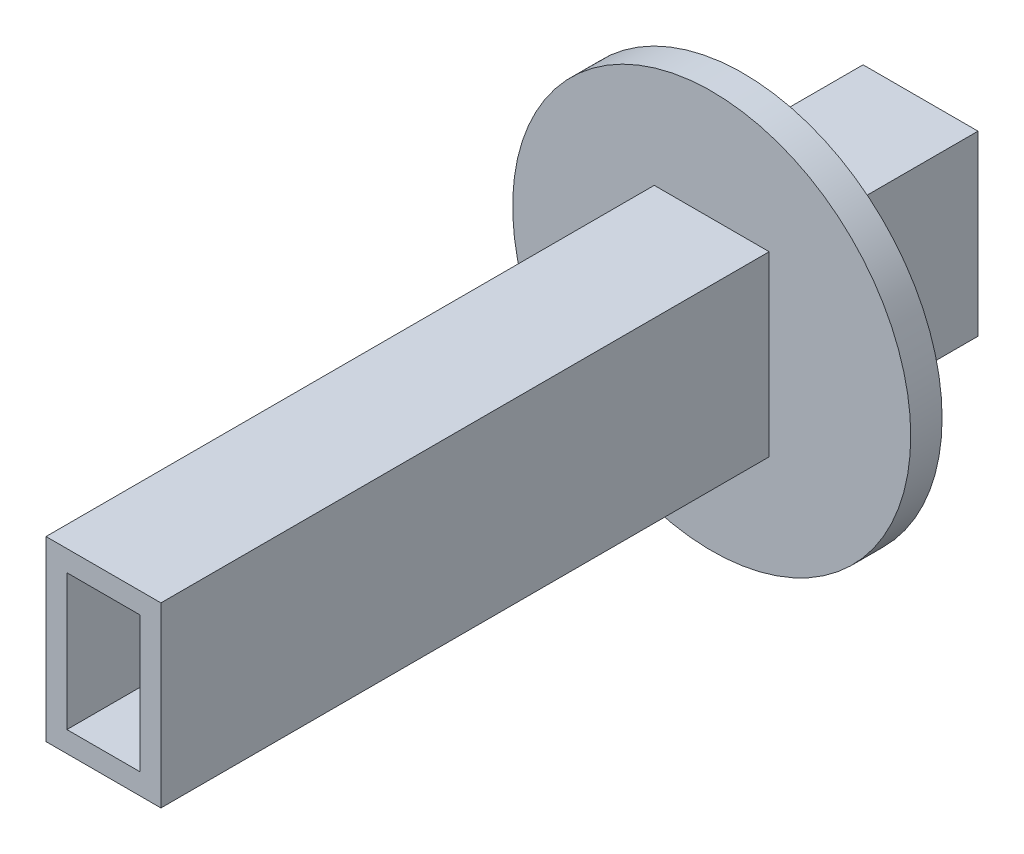
ISO-10303-21;
HEADER;
FILE_DESCRIPTION(('STEP AP214'),'2;1');
FILE_NAME('part.step','',(''),(''),'','','');
FILE_SCHEMA(('AUTOMOTIVE_DESIGN { 1 0 10303 214 1 1 1 1 }'));
ENDSEC;
DATA;
#1=APPLICATION_CONTEXT('core data for automotive mechanical design processes');
#2=APPLICATION_PROTOCOL_DEFINITION('international standard','automotive_design',2000,#1);
#3=PRODUCT_CONTEXT('',#1,'mechanical');
#4=PRODUCT('Part','Part','',(#3));
#5=PRODUCT_RELATED_PRODUCT_CATEGORY('part','',(#4));
#6=PRODUCT_DEFINITION_FORMATION('','',#4);
#7=PRODUCT_DEFINITION_CONTEXT('part definition',#1,'design');
#8=PRODUCT_DEFINITION('design','',#6,#7);
#9=PRODUCT_DEFINITION_SHAPE('','',#8);
#10=(LENGTH_UNIT() NAMED_UNIT(*) SI_UNIT(.MILLI.,.METRE.));
#11=(NAMED_UNIT(*) PLANE_ANGLE_UNIT() SI_UNIT($,.RADIAN.));
#12=(NAMED_UNIT(*) SI_UNIT($,.STERADIAN.) SOLID_ANGLE_UNIT());
#13=UNCERTAINTY_MEASURE_WITH_UNIT(LENGTH_MEASURE(1.E-05),#10,'distance_accuracy_value','');
#14=(GEOMETRIC_REPRESENTATION_CONTEXT(3) GLOBAL_UNCERTAINTY_ASSIGNED_CONTEXT((#13)) GLOBAL_UNIT_ASSIGNED_CONTEXT((#10,
#11,#12)) REPRESENTATION_CONTEXT('',''));
#15=CARTESIAN_POINT('',(0.,0.,0.));
#16=DIRECTION('',(0.,0.,1.));
#17=DIRECTION('',(1.,0.,0.));
#18=AXIS2_PLACEMENT_3D('',#15,#16,#17);
#19=CARTESIAN_POINT('',(3.5,6.5,14.986));
#20=DIRECTION('',(0.,0.,1.));
#21=DIRECTION('',(1.,0.,0.));
#22=AXIS2_PLACEMENT_3D('',#19,#20,#21);
#23=PLANE('',#22);
#24=CARTESIAN_POINT('',(3.5,6.5,14.986));
#25=DIRECTION('',(0.,0.,1.));
#26=DIRECTION('',(1.,0.,0.));
#27=AXIS2_PLACEMENT_3D('',#24,#25,#26);
#28=CIRCLE('',#27,19.05);
#29=CARTESIAN_POINT('',(22.55,6.5,14.986));
#30=VERTEX_POINT('',#29);
#31=EDGE_CURVE('E291',#30,#30,#28,.T.);
#32=ORIENTED_EDGE('',*,*,#31,.F.);
#33=EDGE_LOOP('',(#32));
#34=FACE_BOUND('',#33,.T.);
#35=CARTESIAN_POINT('',(3.5,6.5,14.986));
#36=DIRECTION('',(0.,0.,1.));
#37=DIRECTION('',(1.,0.,0.));
#38=AXIS2_PLACEMENT_3D('',#35,#36,#37);
#39=CIRCLE('',#38,12.7);
#40=CARTESIAN_POINT('',(16.2,6.5,14.986));
#41=VERTEX_POINT('',#40);
#42=EDGE_CURVE('E11',#41,#41,#39,.F.);
#43=ORIENTED_EDGE('',*,*,#42,.F.);
#44=EDGE_LOOP('',(#43));
#45=FACE_BOUND('',#44,.T.);
#46=ADVANCED_FACE('F39',(#34,#45),#23,.F.);
#47=CARTESIAN_POINT('',(-2.,-2.,76.2));
#48=DIRECTION('',(1.,0.,0.));
#49=DIRECTION('',(0.,0.,-1.));
#50=AXIS2_PLACEMENT_3D('',#47,#48,#49);
#51=PLANE('',#50);
#52=DIRECTION('',(0.,0.,-1.));
#53=VECTOR('',#52,1.);
#54=CARTESIAN_POINT('',(-2.,-2.,76.2));
#55=LINE('',#54,#53);
#56=CARTESIAN_POINT('',(-2.,-2.,12.446));
#57=VERTEX_POINT('',#56);
#58=CARTESIAN_POINT('',(-2.,-2.,-2.));
#59=VERTEX_POINT('',#58);
#60=EDGE_CURVE('E168',#57,#59,#55,.T.);
#61=ORIENTED_EDGE('',*,*,#60,.F.);
#62=DIRECTION('',(0.,1.,0.));
#63=VECTOR('',#62,1.);
#64=CARTESIAN_POINT('',(-2.,15.,12.446));
#65=LINE('',#64,#63);
#66=CARTESIAN_POINT('',(-2.,15.,12.446));
#67=VERTEX_POINT('',#66);
#68=EDGE_CURVE('E142',#57,#67,#65,.T.);
#69=ORIENTED_EDGE('',*,*,#68,.T.);
#70=DIRECTION('',(0.,0.,-1.));
#71=VECTOR('',#70,1.);
#72=CARTESIAN_POINT('',(-2.,15.,76.2));
#73=LINE('',#72,#71);
#74=CARTESIAN_POINT('',(-2.,15.,-2.));
#75=VERTEX_POINT('',#74);
#76=EDGE_CURVE('E191',#67,#75,#73,.T.);
#77=ORIENTED_EDGE('',*,*,#76,.T.);
#78=DIRECTION('',(0.,1.,0.));
#79=VECTOR('',#78,1.);
#80=CARTESIAN_POINT('',(-2.,-2.,-2.));
#81=LINE('',#80,#79);
#82=EDGE_CURVE('E184',#59,#75,#81,.T.);
#83=ORIENTED_EDGE('',*,*,#82,.F.);
#84=EDGE_LOOP('',(#61,#69,#77,#83));
#85=FACE_BOUND('',#84,.T.);
#86=ADVANCED_FACE('F189',(#85),#51,.F.);
#87=CARTESIAN_POINT('',(-2.,-2.,76.2));
#88=DIRECTION('',(0.,1.,0.));
#89=DIRECTION('',(0.,0.,1.));
#90=AXIS2_PLACEMENT_3D('',#87,#88,#89);
#91=PLANE('',#90);
#92=DIRECTION('',(0.,0.,-1.));
#93=VECTOR('',#92,1.);
#94=CARTESIAN_POINT('',(0.,-2.,0.));
#95=LINE('',#94,#93);
#96=CARTESIAN_POINT('',(0.,-2.,11.));
#97=VERTEX_POINT('',#96);
#98=CARTESIAN_POINT('',(0.,-2.,0.));
#99=VERTEX_POINT('',#98);
#100=EDGE_CURVE('E284',#97,#99,#95,.T.);
#101=ORIENTED_EDGE('',*,*,#100,.F.);
#102=DIRECTION('',(-1.,0.,0.));
#103=VECTOR('',#102,1.);
#104=CARTESIAN_POINT('',(7.,-2.,11.));
#105=LINE('',#104,#103);
#106=CARTESIAN_POINT('',(7.,-2.,11.));
#107=VERTEX_POINT('',#106);
#108=EDGE_CURVE('E279',#107,#97,#105,.T.);
#109=ORIENTED_EDGE('',*,*,#108,.F.);
#110=DIRECTION('',(0.,0.,1.));
#111=VECTOR('',#110,1.);
#112=CARTESIAN_POINT('',(7.,-2.,0.));
#113=LINE('',#112,#111);
#114=CARTESIAN_POINT('',(7.,-2.,0.));
#115=VERTEX_POINT('',#114);
#116=EDGE_CURVE('E275',#115,#107,#113,.T.);
#117=ORIENTED_EDGE('',*,*,#116,.F.);
#118=DIRECTION('',(1.,0.,0.));
#119=VECTOR('',#118,1.);
#120=CARTESIAN_POINT('',(7.,-2.,0.));
#121=LINE('',#120,#119);
#122=EDGE_CURVE('E274',#99,#115,#121,.T.);
#123=ORIENTED_EDGE('',*,*,#122,.F.);
#124=EDGE_LOOP('',(#101,#109,#117,#123));
#125=FACE_BOUND('',#124,.T.);
#126=DIRECTION('',(0.,0.,-1.));
#127=VECTOR('',#126,1.);
#128=CARTESIAN_POINT('',(9.,-2.,76.2));
#129=LINE('',#128,#127);
#130=CARTESIAN_POINT('',(9.,-2.,12.446));
#131=VERTEX_POINT('',#130);
#132=CARTESIAN_POINT('',(9.,-2.,-2.));
#133=VERTEX_POINT('',#132);
#134=EDGE_CURVE('E152',#131,#133,#129,.T.);
#135=ORIENTED_EDGE('',*,*,#134,.F.);
#136=DIRECTION('',(-1.,0.,0.));
#137=VECTOR('',#136,1.);
#138=CARTESIAN_POINT('',(9.,-2.,12.446));
#139=LINE('',#138,#137);
#140=EDGE_CURVE('E139',#131,#57,#139,.T.);
#141=ORIENTED_EDGE('',*,*,#140,.T.);
#142=ORIENTED_EDGE('',*,*,#60,.T.);
#143=DIRECTION('',(-1.,0.,0.));
#144=VECTOR('',#143,1.);
#145=CARTESIAN_POINT('',(9.,-2.,-2.));
#146=LINE('',#145,#144);
#147=EDGE_CURVE('E159',#133,#59,#146,.T.);
#148=ORIENTED_EDGE('',*,*,#147,.F.);
#149=EDGE_LOOP('',(#135,#141,#142,#148));
#150=FACE_BOUND('',#149,.T.);
#151=ADVANCED_FACE('F157',(#125,#150),#91,.F.);
#152=CARTESIAN_POINT('',(9.,-2.,76.2));
#153=DIRECTION('',(-1.,0.,0.));
#154=DIRECTION('',(0.,0.,1.));
#155=AXIS2_PLACEMENT_3D('',#152,#153,#154);
#156=PLANE('',#155);
#157=DIRECTION('',(0.,0.,-1.));
#158=VECTOR('',#157,1.);
#159=CARTESIAN_POINT('',(9.,15.,76.2));
#160=LINE('',#159,#158);
#161=CARTESIAN_POINT('',(9.,15.,12.446));
#162=VERTEX_POINT('',#161);
#163=CARTESIAN_POINT('',(9.,15.,-2.));
#164=VERTEX_POINT('',#163);
#165=EDGE_CURVE('E154',#162,#164,#160,.T.);
#166=ORIENTED_EDGE('',*,*,#165,.F.);
#167=DIRECTION('',(0.,-1.,0.));
#168=VECTOR('',#167,1.);
#169=CARTESIAN_POINT('',(9.,15.,12.446));
#170=LINE('',#169,#168);
#171=EDGE_CURVE('E55',#162,#131,#170,.T.);
#172=ORIENTED_EDGE('',*,*,#171,.T.);
#173=ORIENTED_EDGE('',*,*,#134,.T.);
#174=DIRECTION('',(0.,-1.,0.));
#175=VECTOR('',#174,1.);
#176=CARTESIAN_POINT('',(9.,-2.,-2.));
#177=LINE('',#176,#175);
#178=EDGE_CURVE('E186',#164,#133,#177,.T.);
#179=ORIENTED_EDGE('',*,*,#178,.F.);
#180=EDGE_LOOP('',(#166,#172,#173,#179));
#181=FACE_BOUND('',#180,.T.);
#182=ADVANCED_FACE('F150',(#181),#156,.F.);
#183=CARTESIAN_POINT('',(-2.,15.,76.2));
#184=DIRECTION('',(0.,-1.,0.));
#185=DIRECTION('',(0.,0.,-1.));
#186=AXIS2_PLACEMENT_3D('',#183,#184,#185);
#187=PLANE('',#186);
#188=ORIENTED_EDGE('',*,*,#76,.F.);
#189=DIRECTION('',(1.,0.,0.));
#190=VECTOR('',#189,1.);
#191=CARTESIAN_POINT('',(9.,15.,12.446));
#192=LINE('',#191,#190);
#193=EDGE_CURVE('E261',#67,#162,#192,.T.);
#194=ORIENTED_EDGE('',*,*,#193,.T.);
#195=ORIENTED_EDGE('',*,*,#165,.T.);
#196=DIRECTION('',(1.,0.,0.));
#197=VECTOR('',#196,1.);
#198=CARTESIAN_POINT('',(9.,15.,-2.));
#199=LINE('',#198,#197);
#200=EDGE_CURVE('E193',#75,#164,#199,.T.);
#201=ORIENTED_EDGE('',*,*,#200,.F.);
#202=EDGE_LOOP('',(#188,#194,#195,#201));
#203=FACE_BOUND('',#202,.T.);
#204=ADVANCED_FACE('F260',(#203),#187,.F.);
#205=CARTESIAN_POINT('',(0.,0.,76.2));
#206=DIRECTION('',(0.,0.,-1.));
#207=DIRECTION('',(-1.,0.,0.));
#208=AXIS2_PLACEMENT_3D('',#205,#206,#207);
#209=PLANE('',#208);
#210=DIRECTION('',(0.,-1.,0.));
#211=VECTOR('',#210,1.);
#212=CARTESIAN_POINT('',(-2.,-2.,76.2));
#213=LINE('',#212,#211);
#214=CARTESIAN_POINT('',(-2.,15.,76.2));
#215=VERTEX_POINT('',#214);
#216=CARTESIAN_POINT('',(-2.,-2.,76.2));
#217=VERTEX_POINT('',#216);
#218=EDGE_CURVE('E239',#215,#217,#213,.T.);
#219=ORIENTED_EDGE('',*,*,#218,.T.);
#220=DIRECTION('',(1.,0.,0.));
#221=VECTOR('',#220,1.);
#222=CARTESIAN_POINT('',(-2.,-2.,76.2));
#223=LINE('',#222,#221);
#224=CARTESIAN_POINT('',(9.,-2.,76.2));
#225=VERTEX_POINT('',#224);
#226=EDGE_CURVE('E243',#217,#225,#223,.T.);
#227=ORIENTED_EDGE('',*,*,#226,.T.);
#228=DIRECTION('',(0.,1.,0.));
#229=VECTOR('',#228,1.);
#230=CARTESIAN_POINT('',(9.,-2.,76.2));
#231=LINE('',#230,#229);
#232=CARTESIAN_POINT('',(9.,15.,76.2));
#233=VERTEX_POINT('',#232);
#234=EDGE_CURVE('E246',#225,#233,#231,.T.);
#235=ORIENTED_EDGE('',*,*,#234,.T.);
#236=DIRECTION('',(-1.,0.,0.));
#237=VECTOR('',#236,1.);
#238=CARTESIAN_POINT('',(-2.,15.,76.2));
#239=LINE('',#238,#237);
#240=EDGE_CURVE('E249',#233,#215,#239,.T.);
#241=ORIENTED_EDGE('',*,*,#240,.T.);
#242=EDGE_LOOP('',(#219,#227,#235,#241));
#243=FACE_BOUND('',#242,.T.);
#244=DIRECTION('',(0.,-1.,0.));
#245=VECTOR('',#244,1.);
#246=CARTESIAN_POINT('',(0.,0.,76.2));
#247=LINE('',#246,#245);
#248=CARTESIAN_POINT('',(0.,13.,76.2));
#249=VERTEX_POINT('',#248);
#250=CARTESIAN_POINT('',(0.,0.,76.2));
#251=VERTEX_POINT('',#250);
#252=EDGE_CURVE('E200',#249,#251,#247,.T.);
#253=ORIENTED_EDGE('',*,*,#252,.F.);
#254=DIRECTION('',(-1.,0.,0.));
#255=VECTOR('',#254,1.);
#256=CARTESIAN_POINT('',(0.,13.,76.2));
#257=LINE('',#256,#255);
#258=CARTESIAN_POINT('',(7.,13.,76.2));
#259=VERTEX_POINT('',#258);
#260=EDGE_CURVE('E211',#259,#249,#257,.T.);
#261=ORIENTED_EDGE('',*,*,#260,.F.);
#262=DIRECTION('',(0.,1.,0.));
#263=VECTOR('',#262,1.);
#264=CARTESIAN_POINT('',(7.,0.,76.2));
#265=LINE('',#264,#263);
#266=CARTESIAN_POINT('',(7.,0.,76.2));
#267=VERTEX_POINT('',#266);
#268=EDGE_CURVE('E207',#267,#259,#265,.T.);
#269=ORIENTED_EDGE('',*,*,#268,.F.);
#270=DIRECTION('',(1.,0.,0.));
#271=VECTOR('',#270,1.);
#272=CARTESIAN_POINT('',(0.,0.,76.2));
#273=LINE('',#272,#271);
#274=EDGE_CURVE('E203',#251,#267,#273,.T.);
#275=ORIENTED_EDGE('',*,*,#274,.F.);
#276=EDGE_LOOP('',(#253,#261,#269,#275));
#277=FACE_BOUND('',#276,.T.);
#278=ADVANCED_FACE('F367',(#243,#277),#209,.F.);
#279=CARTESIAN_POINT('',(-2.,15.,17.986));
#280=VERTEX_POINT('',#279);
#281=EDGE_CURVE('E251',#215,#280,#73,.T.);
#282=ORIENTED_EDGE('',*,*,#281,.T.);
#283=DIRECTION('',(0.,-1.,0.));
#284=VECTOR('',#283,1.);
#285=CARTESIAN_POINT('',(-2.,15.,17.986));
#286=LINE('',#285,#284);
#287=CARTESIAN_POINT('',(-2.,-2.,17.986));
#288=VERTEX_POINT('',#287);
#289=EDGE_CURVE('E63',#280,#288,#286,.T.);
#290=ORIENTED_EDGE('',*,*,#289,.T.);
#291=EDGE_CURVE('E48',#217,#288,#55,.T.);
#292=ORIENTED_EDGE('',*,*,#291,.F.);
#293=ORIENTED_EDGE('',*,*,#218,.F.);
#294=EDGE_LOOP('',(#282,#290,#292,#293));
#295=FACE_BOUND('',#294,.T.);
#296=ADVANCED_FACE('F41',(#295),#51,.F.);
#297=ORIENTED_EDGE('',*,*,#291,.T.);
#298=DIRECTION('',(1.,0.,0.));
#299=VECTOR('',#298,1.);
#300=CARTESIAN_POINT('',(-2.,-2.,17.986));
#301=LINE('',#300,#299);
#302=CARTESIAN_POINT('',(9.,-2.,17.986));
#303=VERTEX_POINT('',#302);
#304=EDGE_CURVE('E305',#288,#303,#301,.T.);
#305=ORIENTED_EDGE('',*,*,#304,.T.);
#306=EDGE_CURVE('E162',#225,#303,#129,.T.);
#307=ORIENTED_EDGE('',*,*,#306,.F.);
#308=ORIENTED_EDGE('',*,*,#226,.F.);
#309=EDGE_LOOP('',(#297,#305,#307,#308));
#310=FACE_BOUND('',#309,.T.);
#311=ADVANCED_FACE('F376',(#310),#91,.F.);
#312=ORIENTED_EDGE('',*,*,#306,.T.);
#313=DIRECTION('',(0.,1.,0.));
#314=VECTOR('',#313,1.);
#315=CARTESIAN_POINT('',(9.,15.,17.986));
#316=LINE('',#315,#314);
#317=CARTESIAN_POINT('',(9.,15.,17.986));
#318=VERTEX_POINT('',#317);
#319=EDGE_CURVE('E301',#303,#318,#316,.T.);
#320=ORIENTED_EDGE('',*,*,#319,.T.);
#321=EDGE_CURVE('E163',#233,#318,#160,.T.);
#322=ORIENTED_EDGE('',*,*,#321,.F.);
#323=ORIENTED_EDGE('',*,*,#234,.F.);
#324=EDGE_LOOP('',(#312,#320,#322,#323));
#325=FACE_BOUND('',#324,.T.);
#326=ADVANCED_FACE('F373',(#325),#156,.F.);
#327=ORIENTED_EDGE('',*,*,#321,.T.);
#328=DIRECTION('',(-1.,0.,0.));
#329=VECTOR('',#328,1.);
#330=CARTESIAN_POINT('',(-2.,15.,17.986));
#331=LINE('',#330,#329);
#332=EDGE_CURVE('E295',#318,#280,#331,.T.);
#333=ORIENTED_EDGE('',*,*,#332,.T.);
#334=ORIENTED_EDGE('',*,*,#281,.F.);
#335=ORIENTED_EDGE('',*,*,#240,.F.);
#336=EDGE_LOOP('',(#327,#333,#334,#335));
#337=FACE_BOUND('',#336,.T.);
#338=ADVANCED_FACE('F365',(#337),#187,.F.);
#339=CARTESIAN_POINT('',(0.,0.,76.2));
#340=DIRECTION('',(1.,0.,0.));
#341=DIRECTION('',(0.,1.,0.));
#342=AXIS2_PLACEMENT_3D('',#339,#340,#341);
#343=PLANE('',#342);
#344=DIRECTION('',(0.,-1.,0.));
#345=VECTOR('',#344,1.);
#346=CARTESIAN_POINT('',(0.,0.,0.));
#347=LINE('',#346,#345);
#348=CARTESIAN_POINT('',(0.,13.,0.));
#349=VERTEX_POINT('',#348);
#350=EDGE_CURVE('E196',#349,#99,#347,.T.);
#351=ORIENTED_EDGE('',*,*,#350,.F.);
#352=DIRECTION('',(0.,0.,-1.));
#353=VECTOR('',#352,1.);
#354=CARTESIAN_POINT('',(0.,13.,76.2));
#355=LINE('',#354,#353);
#356=EDGE_CURVE('E214',#249,#349,#355,.T.);
#357=ORIENTED_EDGE('',*,*,#356,.F.);
#358=ORIENTED_EDGE('',*,*,#252,.T.);
#359=DIRECTION('',(0.,0.,-1.));
#360=VECTOR('',#359,1.);
#361=CARTESIAN_POINT('',(0.,0.,76.2));
#362=LINE('',#361,#360);
#363=CARTESIAN_POINT('',(0.,0.,11.));
#364=VERTEX_POINT('',#363);
#365=EDGE_CURVE('E235',#251,#364,#362,.T.);
#366=ORIENTED_EDGE('',*,*,#365,.T.);
#367=DIRECTION('',(0.,-1.,0.));
#368=VECTOR('',#367,1.);
#369=CARTESIAN_POINT('',(0.,13.0384048104053,11.));
#370=LINE('',#369,#368);
#371=EDGE_CURVE('E265',#364,#97,#370,.T.);
#372=ORIENTED_EDGE('',*,*,#371,.T.);
#373=ORIENTED_EDGE('',*,*,#100,.T.);
#374=EDGE_LOOP('',(#351,#357,#358,#366,#372,#373));
#375=FACE_BOUND('',#374,.T.);
#376=ADVANCED_FACE('F361',(#375),#343,.T.);
#377=CARTESIAN_POINT('',(0.,0.,76.2));
#378=DIRECTION('',(0.,1.,0.));
#379=DIRECTION('',(0.,0.,1.));
#380=AXIS2_PLACEMENT_3D('',#377,#378,#379);
#381=PLANE('',#380);
#382=DIRECTION('',(-1.,0.,0.));
#383=VECTOR('',#382,1.);
#384=CARTESIAN_POINT('',(7.,0.,11.));
#385=LINE('',#384,#383);
#386=CARTESIAN_POINT('',(7.,0.,11.));
#387=VERTEX_POINT('',#386);
#388=EDGE_CURVE('E270',#387,#364,#385,.T.);
#389=ORIENTED_EDGE('',*,*,#388,.T.);
#390=ORIENTED_EDGE('',*,*,#365,.F.);
#391=ORIENTED_EDGE('',*,*,#274,.T.);
#392=DIRECTION('',(0.,0.,-1.));
#393=VECTOR('',#392,1.);
#394=CARTESIAN_POINT('',(7.,0.,76.2));
#395=LINE('',#394,#393);
#396=EDGE_CURVE('E231',#267,#387,#395,.T.);
#397=ORIENTED_EDGE('',*,*,#396,.T.);
#398=EDGE_LOOP('',(#389,#390,#391,#397));
#399=FACE_BOUND('',#398,.T.);
#400=ADVANCED_FACE('F357',(#399),#381,.T.);
#401=CARTESIAN_POINT('',(7.,0.,76.2));
#402=DIRECTION('',(-1.,0.,0.));
#403=DIRECTION('',(0.,-1.,0.));
#404=AXIS2_PLACEMENT_3D('',#401,#402,#403);
#405=PLANE('',#404);
#406=DIRECTION('',(0.,1.,0.));
#407=VECTOR('',#406,1.);
#408=CARTESIAN_POINT('',(7.,0.,0.));
#409=LINE('',#408,#407);
#410=CARTESIAN_POINT('',(7.,13.,0.));
#411=VERTEX_POINT('',#410);
#412=EDGE_CURVE('E217',#115,#411,#409,.T.);
#413=ORIENTED_EDGE('',*,*,#412,.F.);
#414=ORIENTED_EDGE('',*,*,#116,.T.);
#415=DIRECTION('',(0.,-1.,0.));
#416=VECTOR('',#415,1.);
#417=CARTESIAN_POINT('',(7.,13.0384048104053,11.));
#418=LINE('',#417,#416);
#419=EDGE_CURVE('E263',#387,#107,#418,.T.);
#420=ORIENTED_EDGE('',*,*,#419,.F.);
#421=ORIENTED_EDGE('',*,*,#396,.F.);
#422=ORIENTED_EDGE('',*,*,#268,.T.);
#423=DIRECTION('',(0.,0.,-1.));
#424=VECTOR('',#423,1.);
#425=CARTESIAN_POINT('',(7.,13.,76.2));
#426=LINE('',#425,#424);
#427=EDGE_CURVE('E227',#259,#411,#426,.T.);
#428=ORIENTED_EDGE('',*,*,#427,.T.);
#429=EDGE_LOOP('',(#413,#414,#420,#421,#422,#428));
#430=FACE_BOUND('',#429,.T.);
#431=ADVANCED_FACE('F353',(#430),#405,.T.);
#432=CARTESIAN_POINT('',(0.,13.,76.2));
#433=DIRECTION('',(0.,-1.,0.));
#434=DIRECTION('',(0.,0.,-1.));
#435=AXIS2_PLACEMENT_3D('',#432,#433,#434);
#436=PLANE('',#435);
#437=DIRECTION('',(-1.,0.,0.));
#438=VECTOR('',#437,1.);
#439=CARTESIAN_POINT('',(0.,13.,0.));
#440=LINE('',#439,#438);
#441=EDGE_CURVE('E204',#411,#349,#440,.T.);
#442=ORIENTED_EDGE('',*,*,#441,.F.);
#443=ORIENTED_EDGE('',*,*,#427,.F.);
#444=ORIENTED_EDGE('',*,*,#260,.T.);
#445=ORIENTED_EDGE('',*,*,#356,.T.);
#446=EDGE_LOOP('',(#442,#443,#444,#445));
#447=FACE_BOUND('',#446,.T.);
#448=ADVANCED_FACE('F349',(#447),#436,.T.);
#449=CARTESIAN_POINT('',(0.,0.,0.));
#450=DIRECTION('',(0.,0.,1.));
#451=DIRECTION('',(1.,0.,0.));
#452=AXIS2_PLACEMENT_3D('',#449,#450,#451);
#453=PLANE('',#452);
#454=ORIENTED_EDGE('',*,*,#412,.T.);
#455=ORIENTED_EDGE('',*,*,#441,.T.);
#456=ORIENTED_EDGE('',*,*,#350,.T.);
#457=ORIENTED_EDGE('',*,*,#122,.T.);
#458=EDGE_LOOP('',(#454,#455,#456,#457));
#459=FACE_BOUND('',#458,.T.);
#460=ADVANCED_FACE('F346',(#459),#453,.T.);
#461=CARTESIAN_POINT('',(0.,0.,-2.));
#462=DIRECTION('',(0.,0.,1.));
#463=DIRECTION('',(1.,0.,0.));
#464=AXIS2_PLACEMENT_3D('',#461,#462,#463);
#465=PLANE('',#464);
#466=ORIENTED_EDGE('',*,*,#178,.T.);
#467=ORIENTED_EDGE('',*,*,#147,.T.);
#468=ORIENTED_EDGE('',*,*,#82,.T.);
#469=ORIENTED_EDGE('',*,*,#200,.T.);
#470=EDGE_LOOP('',(#466,#467,#468,#469));
#471=FACE_BOUND('',#470,.T.);
#472=ADVANCED_FACE('F182',(#471),#465,.F.);
#473=CARTESIAN_POINT('',(7.,13.0384048104053,11.));
#474=DIRECTION('',(0.,0.,1.));
#475=DIRECTION('',(1.,0.,0.));
#476=AXIS2_PLACEMENT_3D('',#473,#474,#475);
#477=PLANE('',#476);
#478=ORIENTED_EDGE('',*,*,#419,.T.);
#479=ORIENTED_EDGE('',*,*,#108,.T.);
#480=ORIENTED_EDGE('',*,*,#371,.F.);
#481=ORIENTED_EDGE('',*,*,#388,.F.);
#482=EDGE_LOOP('',(#478,#479,#480,#481));
#483=FACE_BOUND('',#482,.T.);
#484=ADVANCED_FACE('F340',(#483),#477,.F.);
#485=CARTESIAN_POINT('',(3.5,6.5,17.986));
#486=DIRECTION('',(0.,0.,1.));
#487=DIRECTION('',(1.,0.,0.));
#488=AXIS2_PLACEMENT_3D('',#485,#486,#487);
#489=PLANE('',#488);
#490=CARTESIAN_POINT('',(3.5,6.5,17.986));
#491=DIRECTION('',(0.,0.,1.));
#492=DIRECTION('',(1.,0.,0.));
#493=AXIS2_PLACEMENT_3D('',#490,#491,#492);
#494=CIRCLE('',#493,19.05);
#495=CARTESIAN_POINT('',(22.55,6.5,17.986));
#496=VERTEX_POINT('',#495);
#497=EDGE_CURVE('E280',#496,#496,#494,.T.);
#498=ORIENTED_EDGE('',*,*,#497,.T.);
#499=EDGE_LOOP('',(#498));
#500=FACE_BOUND('',#499,.T.);
#501=ORIENTED_EDGE('',*,*,#304,.F.);
#502=ORIENTED_EDGE('',*,*,#289,.F.);
#503=ORIENTED_EDGE('',*,*,#332,.F.);
#504=ORIENTED_EDGE('',*,*,#319,.F.);
#505=EDGE_LOOP('',(#501,#502,#503,#504));
#506=FACE_BOUND('',#505,.T.);
#507=ADVANCED_FACE('F335',(#500,#506),#489,.T.);
#508=CARTESIAN_POINT('',(3.5,6.5,17.986));
#509=DIRECTION('',(0.,0.,-1.));
#510=DIRECTION('',(-1.,0.,0.));
#511=AXIS2_PLACEMENT_3D('',#508,#509,#510);
#512=CYLINDRICAL_SURFACE('',#511,19.05);
#513=ORIENTED_EDGE('',*,*,#497,.F.);
#514=EDGE_LOOP('',(#513));
#515=FACE_BOUND('',#514,.T.);
#516=ORIENTED_EDGE('',*,*,#31,.T.);
#517=EDGE_LOOP('',(#516));
#518=FACE_BOUND('',#517,.T.);
#519=ADVANCED_FACE('F336',(#515,#518),#512,.T.);
#520=CARTESIAN_POINT('',(3.5,6.5,12.446));
#521=DIRECTION('',(0.,0.,-1.));
#522=DIRECTION('',(-1.,0.,0.));
#523=AXIS2_PLACEMENT_3D('',#520,#521,#522);
#524=PLANE('',#523);
#525=CARTESIAN_POINT('',(3.5,6.5,12.446));
#526=DIRECTION('',(0.,0.,-1.));
#527=DIRECTION('',(-1.,0.,0.));
#528=AXIS2_PLACEMENT_3D('',#525,#526,#527);
#529=CIRCLE('',#528,12.7);
#530=CARTESIAN_POINT('',(-9.2,6.5,12.446));
#531=VERTEX_POINT('',#530);
#532=EDGE_CURVE('E310',#531,#531,#529,.T.);
#533=ORIENTED_EDGE('',*,*,#532,.T.);
#534=EDGE_LOOP('',(#533));
#535=FACE_BOUND('',#534,.T.);
#536=ORIENTED_EDGE('',*,*,#140,.F.);
#537=ORIENTED_EDGE('',*,*,#171,.F.);
#538=ORIENTED_EDGE('',*,*,#193,.F.);
#539=ORIENTED_EDGE('',*,*,#68,.F.);
#540=EDGE_LOOP('',(#536,#537,#538,#539));
#541=FACE_BOUND('',#540,.T.);
#542=ADVANCED_FACE('F140',(#535,#541),#524,.T.);
#543=CARTESIAN_POINT('',(3.5,6.5,12.446));
#544=DIRECTION('',(0.,0.,1.));
#545=DIRECTION('',(1.,0.,0.));
#546=AXIS2_PLACEMENT_3D('',#543,#544,#545);
#547=CYLINDRICAL_SURFACE('',#546,12.7);
#548=ORIENTED_EDGE('',*,*,#532,.F.);
#549=EDGE_LOOP('',(#548));
#550=FACE_BOUND('',#549,.T.);
#551=ORIENTED_EDGE('',*,*,#42,.T.);
#552=EDGE_LOOP('',(#551));
#553=FACE_BOUND('',#552,.T.);
#554=ADVANCED_FACE('F320',(#550,#553),#547,.T.);
#555=CLOSED_SHELL('',(#46,#86,#151,#182,#204,#278,#296,#311,#326,#338,#376,#400,#431,#448,#460,
#472,#484,#507,#519,#542,#554));
#556=MANIFOLD_SOLID_BREP('B2',#555);
#557=ADVANCED_BREP_SHAPE_REPRESENTATION('',(#18,#556),#14);
#558=SHAPE_DEFINITION_REPRESENTATION(#9,#557);
ENDSEC;
END-ISO-10303-21;
